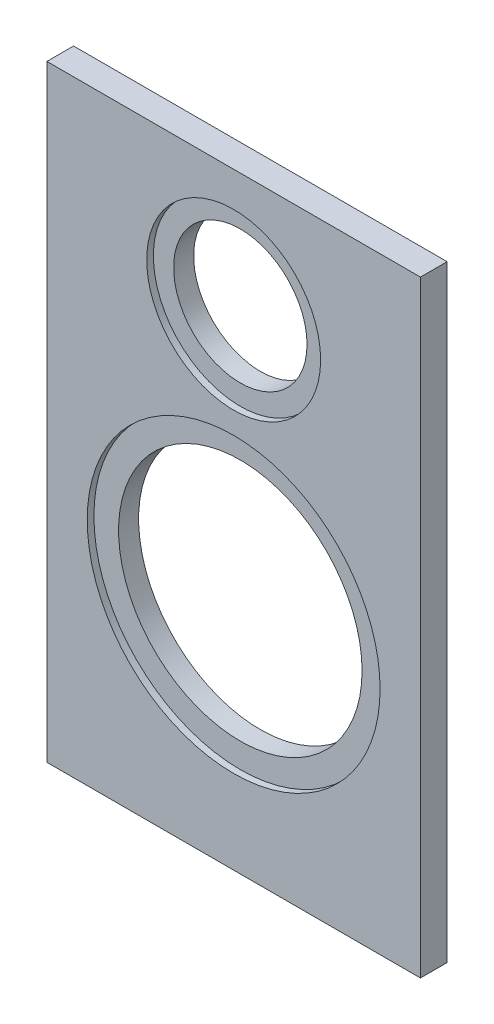
ISO-10303-21;
HEADER;
FILE_DESCRIPTION(('STEP AP214'),'2;1');
FILE_NAME('part.step','',(''),(''),'','','');
FILE_SCHEMA(('AUTOMOTIVE_DESIGN { 1 0 10303 214 1 1 1 1 }'));
ENDSEC;
DATA;
#1=APPLICATION_CONTEXT('core data for automotive mechanical design processes');
#2=APPLICATION_PROTOCOL_DEFINITION('international standard','automotive_design',2000,#1);
#3=PRODUCT_CONTEXT('',#1,'mechanical');
#4=PRODUCT('Part','Part','',(#3));
#5=PRODUCT_RELATED_PRODUCT_CATEGORY('part','',(#4));
#6=PRODUCT_DEFINITION_FORMATION('','',#4);
#7=PRODUCT_DEFINITION_CONTEXT('part definition',#1,'design');
#8=PRODUCT_DEFINITION('design','',#6,#7);
#9=PRODUCT_DEFINITION_SHAPE('','',#8);
#10=(LENGTH_UNIT() NAMED_UNIT(*) SI_UNIT(.MILLI.,.METRE.));
#11=(NAMED_UNIT(*) PLANE_ANGLE_UNIT() SI_UNIT($,.RADIAN.));
#12=(NAMED_UNIT(*) SI_UNIT($,.STERADIAN.) SOLID_ANGLE_UNIT());
#13=UNCERTAINTY_MEASURE_WITH_UNIT(LENGTH_MEASURE(1.E-05),#10,'distance_accuracy_value','');
#14=(GEOMETRIC_REPRESENTATION_CONTEXT(3) GLOBAL_UNCERTAINTY_ASSIGNED_CONTEXT((#13)) GLOBAL_UNIT_ASSIGNED_CONTEXT((#10,
#11,#12)) REPRESENTATION_CONTEXT('',''));
#15=CARTESIAN_POINT('',(0.,0.,0.));
#16=DIRECTION('',(0.,0.,1.));
#17=DIRECTION('',(1.,0.,0.));
#18=AXIS2_PLACEMENT_3D('',#15,#16,#17);
#19=CARTESIAN_POINT('',(-112.,-182.,16.));
#20=DIRECTION('',(1.,0.,0.));
#21=DIRECTION('',(0.,0.,-1.));
#22=AXIS2_PLACEMENT_3D('',#19,#20,#21);
#23=PLANE('',#22);
#24=DIRECTION('',(0.,-1.,0.));
#25=VECTOR('',#24,1.);
#26=CARTESIAN_POINT('',(-112.,-182.,0.));
#27=LINE('',#26,#25);
#28=CARTESIAN_POINT('',(-112.,182.,0.));
#29=VERTEX_POINT('',#28);
#30=CARTESIAN_POINT('',(-112.,-182.,0.));
#31=VERTEX_POINT('',#30);
#32=EDGE_CURVE('E114',#29,#31,#27,.T.);
#33=ORIENTED_EDGE('',*,*,#32,.T.);
#34=DIRECTION('',(0.,0.,-1.));
#35=VECTOR('',#34,1.);
#36=CARTESIAN_POINT('',(-112.,-182.,16.));
#37=LINE('',#36,#35);
#38=CARTESIAN_POINT('',(-112.,-182.,16.));
#39=VERTEX_POINT('',#38);
#40=EDGE_CURVE('E11',#39,#31,#37,.T.);
#41=ORIENTED_EDGE('',*,*,#40,.F.);
#42=DIRECTION('',(0.,-1.,0.));
#43=VECTOR('',#42,1.);
#44=CARTESIAN_POINT('',(-112.,-182.,16.));
#45=LINE('',#44,#43);
#46=CARTESIAN_POINT('',(-112.,182.,16.));
#47=VERTEX_POINT('',#46);
#48=EDGE_CURVE('E97',#47,#39,#45,.T.);
#49=ORIENTED_EDGE('',*,*,#48,.F.);
#50=DIRECTION('',(0.,0.,-1.));
#51=VECTOR('',#50,1.);
#52=CARTESIAN_POINT('',(-112.,182.,16.));
#53=LINE('',#52,#51);
#54=EDGE_CURVE('E110',#47,#29,#53,.T.);
#55=ORIENTED_EDGE('',*,*,#54,.T.);
#56=EDGE_LOOP('',(#33,#41,#49,#55));
#57=FACE_BOUND('',#56,.T.);
#58=ADVANCED_FACE('F43',(#57),#23,.F.);
#59=CARTESIAN_POINT('',(112.,-182.,16.));
#60=DIRECTION('',(0.,1.,0.));
#61=DIRECTION('',(0.,0.,1.));
#62=AXIS2_PLACEMENT_3D('',#59,#60,#61);
#63=PLANE('',#62);
#64=DIRECTION('',(1.,0.,0.));
#65=VECTOR('',#64,1.);
#66=CARTESIAN_POINT('',(112.,-182.,0.));
#67=LINE('',#66,#65);
#68=CARTESIAN_POINT('',(112.,-182.,0.));
#69=VERTEX_POINT('',#68);
#70=EDGE_CURVE('E102',#31,#69,#67,.T.);
#71=ORIENTED_EDGE('',*,*,#70,.T.);
#72=DIRECTION('',(0.,0.,-1.));
#73=VECTOR('',#72,1.);
#74=CARTESIAN_POINT('',(112.,-182.,16.));
#75=LINE('',#74,#73);
#76=CARTESIAN_POINT('',(112.,-182.,16.));
#77=VERTEX_POINT('',#76);
#78=EDGE_CURVE('E53',#77,#69,#75,.T.);
#79=ORIENTED_EDGE('',*,*,#78,.F.);
#80=DIRECTION('',(1.,0.,0.));
#81=VECTOR('',#80,1.);
#82=CARTESIAN_POINT('',(112.,-182.,16.));
#83=LINE('',#82,#81);
#84=EDGE_CURVE('E92',#39,#77,#83,.T.);
#85=ORIENTED_EDGE('',*,*,#84,.F.);
#86=ORIENTED_EDGE('',*,*,#40,.T.);
#87=EDGE_LOOP('',(#71,#79,#85,#86));
#88=FACE_BOUND('',#87,.T.);
#89=ADVANCED_FACE('F101',(#88),#63,.F.);
#90=CARTESIAN_POINT('',(112.,-182.,16.));
#91=DIRECTION('',(-1.,0.,0.));
#92=DIRECTION('',(0.,0.,1.));
#93=AXIS2_PLACEMENT_3D('',#90,#91,#92);
#94=PLANE('',#93);
#95=DIRECTION('',(0.,1.,0.));
#96=VECTOR('',#95,1.);
#97=CARTESIAN_POINT('',(112.,-182.,0.));
#98=LINE('',#97,#96);
#99=CARTESIAN_POINT('',(112.,182.,0.));
#100=VERTEX_POINT('',#99);
#101=EDGE_CURVE('E79',#69,#100,#98,.T.);
#102=ORIENTED_EDGE('',*,*,#101,.T.);
#103=DIRECTION('',(0.,0.,-1.));
#104=VECTOR('',#103,1.);
#105=CARTESIAN_POINT('',(112.,182.,16.));
#106=LINE('',#105,#104);
#107=CARTESIAN_POINT('',(112.,182.,16.));
#108=VERTEX_POINT('',#107);
#109=EDGE_CURVE('E104',#108,#100,#106,.T.);
#110=ORIENTED_EDGE('',*,*,#109,.F.);
#111=DIRECTION('',(0.,1.,0.));
#112=VECTOR('',#111,1.);
#113=CARTESIAN_POINT('',(112.,-182.,16.));
#114=LINE('',#113,#112);
#115=EDGE_CURVE('E95',#77,#108,#114,.T.);
#116=ORIENTED_EDGE('',*,*,#115,.F.);
#117=ORIENTED_EDGE('',*,*,#78,.T.);
#118=EDGE_LOOP('',(#102,#110,#116,#117));
#119=FACE_BOUND('',#118,.T.);
#120=ADVANCED_FACE('F106',(#119),#94,.F.);
#121=CARTESIAN_POINT('',(112.,182.,16.));
#122=DIRECTION('',(0.,-1.,0.));
#123=DIRECTION('',(0.,0.,-1.));
#124=AXIS2_PLACEMENT_3D('',#121,#122,#123);
#125=PLANE('',#124);
#126=DIRECTION('',(-1.,0.,0.));
#127=VECTOR('',#126,1.);
#128=CARTESIAN_POINT('',(112.,182.,0.));
#129=LINE('',#128,#127);
#130=EDGE_CURVE('E85',#100,#29,#129,.T.);
#131=ORIENTED_EDGE('',*,*,#130,.T.);
#132=ORIENTED_EDGE('',*,*,#54,.F.);
#133=DIRECTION('',(-1.,0.,0.));
#134=VECTOR('',#133,1.);
#135=CARTESIAN_POINT('',(112.,182.,16.));
#136=LINE('',#135,#134);
#137=EDGE_CURVE('E62',#108,#47,#136,.T.);
#138=ORIENTED_EDGE('',*,*,#137,.F.);
#139=ORIENTED_EDGE('',*,*,#109,.T.);
#140=EDGE_LOOP('',(#131,#132,#138,#139));
#141=FACE_BOUND('',#140,.T.);
#142=ADVANCED_FACE('F173',(#141),#125,.F.);
#143=CARTESIAN_POINT('',(0.,0.,16.));
#144=DIRECTION('',(0.,0.,1.));
#145=DIRECTION('',(1.,0.,0.));
#146=AXIS2_PLACEMENT_3D('',#143,#144,#145);
#147=PLANE('',#146);
#148=CARTESIAN_POINT('',(0.,109.,16.));
#149=DIRECTION('',(0.,0.,1.));
#150=DIRECTION('',(1.,0.,0.));
#151=AXIS2_PLACEMENT_3D('',#148,#149,#150);
#152=CIRCLE('',#151,52.15);
#153=CARTESIAN_POINT('',(52.15,109.,16.));
#154=VERTEX_POINT('',#153);
#155=EDGE_CURVE('E150',#154,#154,#152,.T.);
#156=ORIENTED_EDGE('',*,*,#155,.F.);
#157=EDGE_LOOP('',(#156));
#158=FACE_BOUND('',#157,.T.);
#159=CARTESIAN_POINT('',(0.,-44.,16.));
#160=DIRECTION('',(0.,0.,1.));
#161=DIRECTION('',(1.,0.,0.));
#162=AXIS2_PLACEMENT_3D('',#159,#160,#161);
#163=CIRCLE('',#162,87.8);
#164=CARTESIAN_POINT('',(87.8,-44.,16.));
#165=VERTEX_POINT('',#164);
#166=EDGE_CURVE('E154',#165,#165,#163,.T.);
#167=ORIENTED_EDGE('',*,*,#166,.F.);
#168=EDGE_LOOP('',(#167));
#169=FACE_BOUND('',#168,.T.);
#170=ORIENTED_EDGE('',*,*,#48,.T.);
#171=ORIENTED_EDGE('',*,*,#84,.T.);
#172=ORIENTED_EDGE('',*,*,#115,.T.);
#173=ORIENTED_EDGE('',*,*,#137,.T.);
#174=EDGE_LOOP('',(#170,#171,#172,#173));
#175=FACE_BOUND('',#174,.T.);
#176=ADVANCED_FACE('F93',(#158,#169,#175),#147,.T.);
#177=CARTESIAN_POINT('',(0.,0.,0.));
#178=DIRECTION('',(0.,0.,1.));
#179=DIRECTION('',(1.,0.,0.));
#180=AXIS2_PLACEMENT_3D('',#177,#178,#179);
#181=PLANE('',#180);
#182=CARTESIAN_POINT('',(0.,109.,0.));
#183=DIRECTION('',(0.,0.,1.));
#184=DIRECTION('',(1.,0.,0.));
#185=AXIS2_PLACEMENT_3D('',#182,#183,#184);
#186=CIRCLE('',#185,40.);
#187=CARTESIAN_POINT('',(40.,109.,0.));
#188=VERTEX_POINT('',#187);
#189=EDGE_CURVE('E131',#188,#188,#186,.T.);
#190=ORIENTED_EDGE('',*,*,#189,.T.);
#191=EDGE_LOOP('',(#190));
#192=FACE_BOUND('',#191,.T.);
#193=CARTESIAN_POINT('',(0.,-44.,0.));
#194=DIRECTION('',(0.,0.,1.));
#195=DIRECTION('',(1.,0.,0.));
#196=AXIS2_PLACEMENT_3D('',#193,#194,#195);
#197=CIRCLE('',#196,73.);
#198=CARTESIAN_POINT('',(73.,-44.,0.));
#199=VERTEX_POINT('',#198);
#200=EDGE_CURVE('E139',#199,#199,#197,.T.);
#201=ORIENTED_EDGE('',*,*,#200,.T.);
#202=EDGE_LOOP('',(#201));
#203=FACE_BOUND('',#202,.T.);
#204=ORIENTED_EDGE('',*,*,#32,.F.);
#205=ORIENTED_EDGE('',*,*,#130,.F.);
#206=ORIENTED_EDGE('',*,*,#101,.F.);
#207=ORIENTED_EDGE('',*,*,#70,.F.);
#208=EDGE_LOOP('',(#204,#205,#206,#207));
#209=FACE_BOUND('',#208,.T.);
#210=ADVANCED_FACE('F168',(#192,#203,#209),#181,.F.);
#211=CARTESIAN_POINT('',(0.,-44.,12.));
#212=DIRECTION('',(0.,0.,1.));
#213=DIRECTION('',(1.,0.,0.));
#214=AXIS2_PLACEMENT_3D('',#211,#212,#213);
#215=CYLINDRICAL_SURFACE('',#214,87.8);
#216=CARTESIAN_POINT('',(0.,-44.,12.));
#217=DIRECTION('',(0.,0.,1.));
#218=DIRECTION('',(1.,0.,0.));
#219=AXIS2_PLACEMENT_3D('',#216,#217,#218);
#220=CIRCLE('',#219,87.8);
#221=CARTESIAN_POINT('',(87.8,-44.,12.));
#222=VERTEX_POINT('',#221);
#223=EDGE_CURVE('E137',#222,#222,#220,.T.);
#224=ORIENTED_EDGE('',*,*,#223,.F.);
#225=EDGE_LOOP('',(#224));
#226=FACE_BOUND('',#225,.T.);
#227=ORIENTED_EDGE('',*,*,#166,.T.);
#228=EDGE_LOOP('',(#227));
#229=FACE_BOUND('',#228,.T.);
#230=ADVANCED_FACE('F165',(#226,#229),#215,.F.);
#231=CARTESIAN_POINT('',(0.,-44.,12.));
#232=DIRECTION('',(0.,0.,1.));
#233=DIRECTION('',(1.,0.,0.));
#234=AXIS2_PLACEMENT_3D('',#231,#232,#233);
#235=PLANE('',#234);
#236=CARTESIAN_POINT('',(0.,-44.,12.));
#237=DIRECTION('',(0.,0.,1.));
#238=DIRECTION('',(1.,0.,0.));
#239=AXIS2_PLACEMENT_3D('',#236,#237,#238);
#240=CIRCLE('',#239,73.);
#241=CARTESIAN_POINT('',(73.,-44.,12.));
#242=VERTEX_POINT('',#241);
#243=EDGE_CURVE('E46',#242,#242,#240,.T.);
#244=ORIENTED_EDGE('',*,*,#243,.F.);
#245=EDGE_LOOP('',(#244));
#246=FACE_BOUND('',#245,.T.);
#247=ORIENTED_EDGE('',*,*,#223,.T.);
#248=EDGE_LOOP('',(#247));
#249=FACE_BOUND('',#248,.T.);
#250=ADVANCED_FACE('F163',(#246,#249),#235,.T.);
#251=CARTESIAN_POINT('',(0.,109.,12.));
#252=DIRECTION('',(0.,0.,1.));
#253=DIRECTION('',(1.,0.,0.));
#254=AXIS2_PLACEMENT_3D('',#251,#252,#253);
#255=CYLINDRICAL_SURFACE('',#254,52.15);
#256=CARTESIAN_POINT('',(0.,109.,12.));
#257=DIRECTION('',(0.,0.,1.));
#258=DIRECTION('',(1.,0.,0.));
#259=AXIS2_PLACEMENT_3D('',#256,#257,#258);
#260=CIRCLE('',#259,52.15);
#261=CARTESIAN_POINT('',(52.15,109.,12.));
#262=VERTEX_POINT('',#261);
#263=EDGE_CURVE('E118',#262,#262,#260,.T.);
#264=ORIENTED_EDGE('',*,*,#263,.F.);
#265=EDGE_LOOP('',(#264));
#266=FACE_BOUND('',#265,.T.);
#267=ORIENTED_EDGE('',*,*,#155,.T.);
#268=EDGE_LOOP('',(#267));
#269=FACE_BOUND('',#268,.T.);
#270=ADVANCED_FACE('F222',(#266,#269),#255,.F.);
#271=CARTESIAN_POINT('',(0.,109.,12.));
#272=DIRECTION('',(0.,0.,1.));
#273=DIRECTION('',(1.,0.,0.));
#274=AXIS2_PLACEMENT_3D('',#271,#272,#273);
#275=PLANE('',#274);
#276=CARTESIAN_POINT('',(0.,109.,12.));
#277=DIRECTION('',(0.,0.,1.));
#278=DIRECTION('',(1.,0.,0.));
#279=AXIS2_PLACEMENT_3D('',#276,#277,#278);
#280=CIRCLE('',#279,40.);
#281=CARTESIAN_POINT('',(40.,109.,12.));
#282=VERTEX_POINT('',#281);
#283=EDGE_CURVE('E128',#282,#282,#280,.T.);
#284=ORIENTED_EDGE('',*,*,#283,.F.);
#285=EDGE_LOOP('',(#284));
#286=FACE_BOUND('',#285,.T.);
#287=ORIENTED_EDGE('',*,*,#263,.T.);
#288=EDGE_LOOP('',(#287));
#289=FACE_BOUND('',#288,.T.);
#290=ADVANCED_FACE('F227',(#286,#289),#275,.T.);
#291=CARTESIAN_POINT('',(0.,109.,0.));
#292=DIRECTION('',(0.,0.,1.));
#293=DIRECTION('',(1.,0.,0.));
#294=AXIS2_PLACEMENT_3D('',#291,#292,#293);
#295=CYLINDRICAL_SURFACE('',#294,40.);
#296=ORIENTED_EDGE('',*,*,#283,.T.);
#297=EDGE_LOOP('',(#296));
#298=FACE_BOUND('',#297,.T.);
#299=ORIENTED_EDGE('',*,*,#189,.F.);
#300=EDGE_LOOP('',(#299));
#301=FACE_BOUND('',#300,.T.);
#302=ADVANCED_FACE('F251',(#298,#301),#295,.F.);
#303=CARTESIAN_POINT('',(0.,-44.,0.));
#304=DIRECTION('',(0.,0.,1.));
#305=DIRECTION('',(1.,0.,0.));
#306=AXIS2_PLACEMENT_3D('',#303,#304,#305);
#307=CYLINDRICAL_SURFACE('',#306,73.);
#308=ORIENTED_EDGE('',*,*,#243,.T.);
#309=EDGE_LOOP('',(#308));
#310=FACE_BOUND('',#309,.T.);
#311=ORIENTED_EDGE('',*,*,#200,.F.);
#312=EDGE_LOOP('',(#311));
#313=FACE_BOUND('',#312,.T.);
#314=ADVANCED_FACE('F262',(#310,#313),#307,.F.);
#315=CLOSED_SHELL('',(#58,#89,#120,#142,#176,#210,#230,#250,#270,#290,#302,#314));
#316=MANIFOLD_SOLID_BREP('B2',#315);
#317=ADVANCED_BREP_SHAPE_REPRESENTATION('',(#18,#316),#14);
#318=SHAPE_DEFINITION_REPRESENTATION(#9,#317);
ENDSEC;
END-ISO-10303-21;
